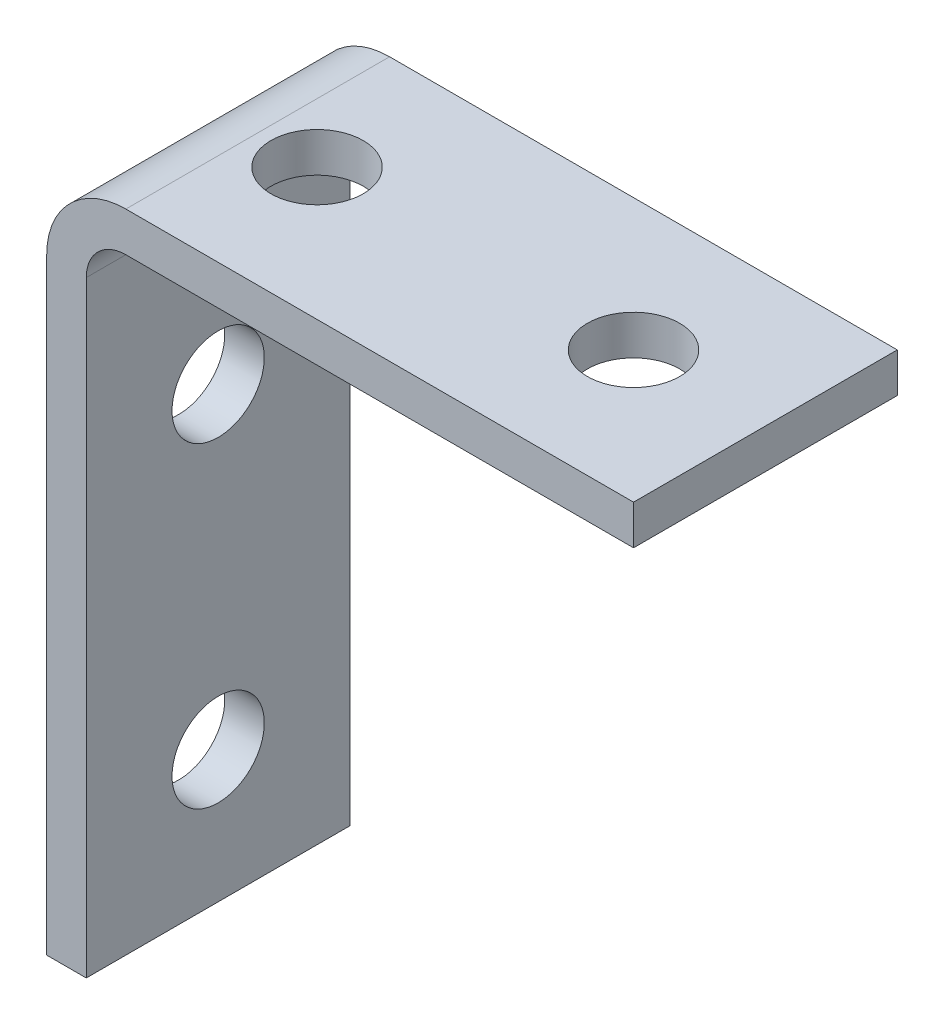
ISO-10303-21;
HEADER;
FILE_DESCRIPTION(('STEP AP214'),'2;1');
FILE_NAME('part.step','',(''),(''),'','','');
FILE_SCHEMA(('AUTOMOTIVE_DESIGN { 1 0 10303 214 1 1 1 1 }'));
ENDSEC;
DATA;
#1=APPLICATION_CONTEXT('core data for automotive mechanical design processes');
#2=APPLICATION_PROTOCOL_DEFINITION('international standard','automotive_design',2000,#1);
#3=PRODUCT_CONTEXT('',#1,'mechanical');
#4=PRODUCT('Part','Part','',(#3));
#5=PRODUCT_RELATED_PRODUCT_CATEGORY('part','',(#4));
#6=PRODUCT_DEFINITION_FORMATION('','',#4);
#7=PRODUCT_DEFINITION_CONTEXT('part definition',#1,'design');
#8=PRODUCT_DEFINITION('design','',#6,#7);
#9=PRODUCT_DEFINITION_SHAPE('','',#8);
#10=(LENGTH_UNIT() NAMED_UNIT(*) SI_UNIT(.MILLI.,.METRE.));
#11=(NAMED_UNIT(*) PLANE_ANGLE_UNIT() SI_UNIT($,.RADIAN.));
#12=(NAMED_UNIT(*) SI_UNIT($,.STERADIAN.) SOLID_ANGLE_UNIT());
#13=UNCERTAINTY_MEASURE_WITH_UNIT(LENGTH_MEASURE(1.E-05),#10,'distance_accuracy_value','');
#14=(GEOMETRIC_REPRESENTATION_CONTEXT(3) GLOBAL_UNCERTAINTY_ASSIGNED_CONTEXT((#13)) GLOBAL_UNIT_ASSIGNED_CONTEXT((#10,
#11,#12)) REPRESENTATION_CONTEXT('',''));
#15=CARTESIAN_POINT('',(0.,0.,0.));
#16=DIRECTION('',(0.,0.,1.));
#17=DIRECTION('',(1.,0.,0.));
#18=AXIS2_PLACEMENT_3D('',#15,#16,#17);
#19=CARTESIAN_POINT('',(3.62528103796382E-13,104.000000000001,-40.0000000000001));
#20=DIRECTION('',(-1.,0.,0.));
#21=DIRECTION('',(0.,-1.,0.));
#22=AXIS2_PLACEMENT_3D('',#19,#20,#21);
#23=PLANE('',#22);
#24=CARTESIAN_POINT('',(0.,68.0000000000013,-19.9999999999999));
#25=DIRECTION('',(-1.,0.,0.));
#26=DIRECTION('',(0.,0.,1.));
#27=AXIS2_PLACEMENT_3D('',#24,#25,#26);
#28=CIRCLE('',#27,6.99999999999998);
#29=CARTESIAN_POINT('',(0.,68.0000000000013,-13.));
#30=VERTEX_POINT('',#29);
#31=EDGE_CURVE('E145',#30,#30,#28,.T.);
#32=ORIENTED_EDGE('',*,*,#31,.F.);
#33=EDGE_LOOP('',(#32));
#34=FACE_BOUND('',#33,.T.);
#35=CARTESIAN_POINT('',(0.,20.0000000000014,-19.9999999999999));
#36=DIRECTION('',(-1.,0.,0.));
#37=DIRECTION('',(0.,0.,1.));
#38=AXIS2_PLACEMENT_3D('',#35,#36,#37);
#39=CIRCLE('',#38,6.99999999999998);
#40=CARTESIAN_POINT('',(0.,20.0000000000014,-13.));
#41=VERTEX_POINT('',#40);
#42=EDGE_CURVE('E141',#41,#41,#39,.T.);
#43=ORIENTED_EDGE('',*,*,#42,.F.);
#44=EDGE_LOOP('',(#43));
#45=FACE_BOUND('',#44,.T.);
#46=DIRECTION('',(0.,-1.,0.));
#47=VECTOR('',#46,1.);
#48=CARTESIAN_POINT('',(3.62528103796382E-13,104.000000000001,0.));
#49=LINE('',#48,#47);
#50=CARTESIAN_POINT('',(3.60329697386423E-13,92.0000000000014,0.));
#51=VERTEX_POINT('',#50);
#52=CARTESIAN_POINT('',(3.43475248243408E-13,1.25512545235545E-12,0.));
#53=VERTEX_POINT('',#52);
#54=EDGE_CURVE('E119',#51,#53,#49,.T.);
#55=ORIENTED_EDGE('',*,*,#54,.F.);
#56=DIRECTION('',(0.,0.,1.));
#57=VECTOR('',#56,1.);
#58=CARTESIAN_POINT('',(3.60329697386423E-13,92.0000000000014,-40.0000000000001));
#59=LINE('',#58,#57);
#60=CARTESIAN_POINT('',(3.60329697386423E-13,92.0000000000014,-40.0000000000001));
#61=VERTEX_POINT('',#60);
#62=EDGE_CURVE('E41',#51,#61,#59,.F.);
#63=ORIENTED_EDGE('',*,*,#62,.T.);
#64=DIRECTION('',(0.,-1.,0.));
#65=VECTOR('',#64,1.);
#66=CARTESIAN_POINT('',(3.62528103796382E-13,104.000000000001,-40.0000000000001));
#67=LINE('',#66,#65);
#68=CARTESIAN_POINT('',(3.43475248243408E-13,1.25512545235545E-12,-40.0000000000001));
#69=VERTEX_POINT('',#68);
#70=EDGE_CURVE('E129',#61,#69,#67,.T.);
#71=ORIENTED_EDGE('',*,*,#70,.T.);
#72=DIRECTION('',(0.,0.,1.));
#73=VECTOR('',#72,1.);
#74=CARTESIAN_POINT('',(3.43475248243408E-13,1.25512545235545E-12,-40.0000000000001));
#75=LINE('',#74,#73);
#76=EDGE_CURVE('E134',#69,#53,#75,.T.);
#77=ORIENTED_EDGE('',*,*,#76,.T.);
#78=EDGE_LOOP('',(#55,#63,#71,#77));
#79=FACE_BOUND('',#78,.T.);
#80=ADVANCED_FACE('F33',(#34,#45,#79),#23,.T.);
#81=CARTESIAN_POINT('',(89.0000000000004,104.000000000001,-40.0000000000001));
#82=DIRECTION('',(0.,1.,0.));
#83=DIRECTION('',(-1.,0.,0.));
#84=AXIS2_PLACEMENT_3D('',#81,#82,#83);
#85=PLANE('',#84);
#86=CARTESIAN_POINT('',(69.0000000000004,104.000000000001,-20.));
#87=DIRECTION('',(0.,-1.,0.));
#88=DIRECTION('',(0.,0.,-1.));
#89=AXIS2_PLACEMENT_3D('',#86,#87,#88);
#90=CIRCLE('',#89,6.99999999999998);
#91=CARTESIAN_POINT('',(69.0000000000004,104.000000000001,-26.9999999999999));
#92=VERTEX_POINT('',#91);
#93=EDGE_CURVE('E194',#92,#92,#90,.T.);
#94=ORIENTED_EDGE('',*,*,#93,.T.);
#95=EDGE_LOOP('',(#94));
#96=FACE_BOUND('',#95,.T.);
#97=CARTESIAN_POINT('',(21.0000000000004,104.000000000001,-19.9999999999999));
#98=DIRECTION('',(0.,-1.,0.));
#99=DIRECTION('',(0.,0.,-1.));
#100=AXIS2_PLACEMENT_3D('',#97,#98,#99);
#101=CIRCLE('',#100,6.99999999999998);
#102=CARTESIAN_POINT('',(21.0000000000004,104.000000000001,-26.9999999999999));
#103=VERTEX_POINT('',#102);
#104=EDGE_CURVE('E188',#103,#103,#101,.T.);
#105=ORIENTED_EDGE('',*,*,#104,.T.);
#106=EDGE_LOOP('',(#105));
#107=FACE_BOUND('',#106,.T.);
#108=DIRECTION('',(-1.,0.,0.));
#109=VECTOR('',#108,1.);
#110=CARTESIAN_POINT('',(89.0000000000004,104.000000000001,-40.0000000000001));
#111=LINE('',#110,#109);
#112=CARTESIAN_POINT('',(89.0000000000004,104.000000000001,-40.0000000000001));
#113=VERTEX_POINT('',#112);
#114=CARTESIAN_POINT('',(12.0000000000004,104.000000000001,-40.0000000000001));
#115=VERTEX_POINT('',#114);
#116=EDGE_CURVE('E136',#113,#115,#111,.T.);
#117=ORIENTED_EDGE('',*,*,#116,.T.);
#118=DIRECTION('',(0.,0.,1.));
#119=VECTOR('',#118,1.);
#120=CARTESIAN_POINT('',(12.0000000000004,104.000000000001,-40.0000000000001));
#121=LINE('',#120,#119);
#122=CARTESIAN_POINT('',(12.0000000000004,104.000000000001,0.));
#123=VERTEX_POINT('',#122);
#124=EDGE_CURVE('E153',#115,#123,#121,.T.);
#125=ORIENTED_EDGE('',*,*,#124,.T.);
#126=DIRECTION('',(-1.,0.,0.));
#127=VECTOR('',#126,1.);
#128=CARTESIAN_POINT('',(89.0000000000004,104.000000000001,0.));
#129=LINE('',#128,#127);
#130=CARTESIAN_POINT('',(89.0000000000004,104.000000000001,0.));
#131=VERTEX_POINT('',#130);
#132=EDGE_CURVE('E123',#131,#123,#129,.T.);
#133=ORIENTED_EDGE('',*,*,#132,.F.);
#134=DIRECTION('',(0.,0.,1.));
#135=VECTOR('',#134,1.);
#136=CARTESIAN_POINT('',(89.0000000000004,104.000000000001,-40.0000000000001));
#137=LINE('',#136,#135);
#138=EDGE_CURVE('E130',#113,#131,#137,.T.);
#139=ORIENTED_EDGE('',*,*,#138,.F.);
#140=EDGE_LOOP('',(#117,#125,#133,#139));
#141=FACE_BOUND('',#140,.T.);
#142=ADVANCED_FACE('F160',(#96,#107,#141),#85,.T.);
#143=CARTESIAN_POINT('',(89.0000000000003,1.1820586420493E-12,-40.0000000000001));
#144=DIRECTION('',(1.,0.,0.));
#145=DIRECTION('',(0.,1.,0.));
#146=AXIS2_PLACEMENT_3D('',#143,#144,#145);
#147=PLANE('',#146);
#148=DIRECTION('',(0.,0.,-1.));
#149=VECTOR('',#148,1.);
#150=CARTESIAN_POINT('',(89.0000000000004,98.0000000000012,0.));
#151=LINE('',#150,#149);
#152=CARTESIAN_POINT('',(89.0000000000004,98.0000000000012,0.));
#153=VERTEX_POINT('',#152);
#154=CARTESIAN_POINT('',(89.0000000000004,98.0000000000012,-40.0000000000001));
#155=VERTEX_POINT('',#154);
#156=EDGE_CURVE('E116',#153,#155,#151,.T.);
#157=ORIENTED_EDGE('',*,*,#156,.T.);
#158=DIRECTION('',(0.,1.,0.));
#159=VECTOR('',#158,1.);
#160=CARTESIAN_POINT('',(89.0000000000003,1.1820586420493E-12,-40.0000000000001));
#161=LINE('',#160,#159);
#162=EDGE_CURVE('E172',#155,#113,#161,.T.);
#163=ORIENTED_EDGE('',*,*,#162,.T.);
#164=ORIENTED_EDGE('',*,*,#138,.T.);
#165=DIRECTION('',(0.,1.,0.));
#166=VECTOR('',#165,1.);
#167=CARTESIAN_POINT('',(89.0000000000003,1.1820586420493E-12,0.));
#168=LINE('',#167,#166);
#169=EDGE_CURVE('E121',#153,#131,#168,.T.);
#170=ORIENTED_EDGE('',*,*,#169,.F.);
#171=EDGE_LOOP('',(#157,#163,#164,#170));
#172=FACE_BOUND('',#171,.T.);
#173=ADVANCED_FACE('F170',(#172),#147,.T.);
#174=CARTESIAN_POINT('',(3.43475248243408E-13,1.25512545235545E-12,-40.0000000000001));
#175=DIRECTION('',(0.,-1.,0.));
#176=DIRECTION('',(1.,0.,0.));
#177=AXIS2_PLACEMENT_3D('',#174,#175,#176);
#178=PLANE('',#177);
#179=DIRECTION('',(0.,0.,-1.));
#180=VECTOR('',#179,1.);
#181=CARTESIAN_POINT('',(6.00000000000035,1.27474981358168E-12,0.));
#182=LINE('',#181,#180);
#183=CARTESIAN_POINT('',(6.00000000000035,1.27474981358168E-12,0.));
#184=VERTEX_POINT('',#183);
#185=CARTESIAN_POINT('',(6.00000000000033,1.2757531459503E-12,-40.0000000000001));
#186=VERTEX_POINT('',#185);
#187=EDGE_CURVE('E99',#184,#186,#182,.T.);
#188=ORIENTED_EDGE('',*,*,#187,.F.);
#189=DIRECTION('',(1.,0.,0.));
#190=VECTOR('',#189,1.);
#191=CARTESIAN_POINT('',(3.43475248243408E-13,1.25512545235545E-12,0.));
#192=LINE('',#191,#190);
#193=EDGE_CURVE('E113',#53,#184,#192,.T.);
#194=ORIENTED_EDGE('',*,*,#193,.F.);
#195=ORIENTED_EDGE('',*,*,#76,.F.);
#196=DIRECTION('',(1.,0.,0.));
#197=VECTOR('',#196,1.);
#198=CARTESIAN_POINT('',(3.43475248243408E-13,1.25512545235545E-12,-40.0000000000001));
#199=LINE('',#198,#197);
#200=EDGE_CURVE('E115',#69,#186,#199,.T.);
#201=ORIENTED_EDGE('',*,*,#200,.T.);
#202=EDGE_LOOP('',(#188,#194,#195,#201));
#203=FACE_BOUND('',#202,.T.);
#204=ADVANCED_FACE('F111',(#203),#178,.T.);
#205=CARTESIAN_POINT('',(0.,0.,-40.0000000000001));
#206=DIRECTION('',(0.,0.,1.));
#207=DIRECTION('',(1.,0.,0.));
#208=AXIS2_PLACEMENT_3D('',#205,#206,#207);
#209=PLANE('',#208);
#210=ORIENTED_EDGE('',*,*,#70,.F.);
#211=CARTESIAN_POINT('',(12.0000000000004,92.0000000000014,-40.0000000000001));
#212=DIRECTION('',(0.,0.,1.));
#213=DIRECTION('',(1.,0.,0.));
#214=AXIS2_PLACEMENT_3D('',#211,#212,#213);
#215=CIRCLE('',#214,12.);
#216=EDGE_CURVE('E11',#61,#115,#215,.F.);
#217=ORIENTED_EDGE('',*,*,#216,.T.);
#218=ORIENTED_EDGE('',*,*,#116,.F.);
#219=ORIENTED_EDGE('',*,*,#162,.F.);
#220=DIRECTION('',(1.,0.,0.));
#221=VECTOR('',#220,1.);
#222=CARTESIAN_POINT('',(6.00000000000037,98.0000000000012,-40.0000000000001));
#223=LINE('',#222,#221);
#224=CARTESIAN_POINT('',(12.0000000000004,98.0000000000012,-40.0000000000001));
#225=VERTEX_POINT('',#224);
#226=EDGE_CURVE('E106',#225,#155,#223,.T.);
#227=ORIENTED_EDGE('',*,*,#226,.F.);
#228=CARTESIAN_POINT('',(12.0000000000004,92.0000000000012,-40.0000000000001));
#229=DIRECTION('',(0.,0.,1.));
#230=DIRECTION('',(1.,0.,0.));
#231=AXIS2_PLACEMENT_3D('',#228,#229,#230);
#232=CIRCLE('',#231,6.);
#233=CARTESIAN_POINT('',(6.00000000000037,92.0000000000012,-40.0000000000001));
#234=VERTEX_POINT('',#233);
#235=EDGE_CURVE('E149',#225,#234,#232,.T.);
#236=ORIENTED_EDGE('',*,*,#235,.T.);
#237=DIRECTION('',(0.,1.,0.));
#238=VECTOR('',#237,1.);
#239=CARTESIAN_POINT('',(6.00000000000033,1.2757531459503E-12,-40.0000000000001));
#240=LINE('',#239,#238);
#241=EDGE_CURVE('E140',#186,#234,#240,.T.);
#242=ORIENTED_EDGE('',*,*,#241,.F.);
#243=ORIENTED_EDGE('',*,*,#200,.F.);
#244=EDGE_LOOP('',(#210,#217,#218,#219,#227,#236,#242,#243));
#245=FACE_BOUND('',#244,.T.);
#246=ADVANCED_FACE('F174',(#245),#209,.F.);
#247=CARTESIAN_POINT('',(0.,0.,0.));
#248=DIRECTION('',(0.,0.,1.));
#249=DIRECTION('',(1.,0.,0.));
#250=AXIS2_PLACEMENT_3D('',#247,#248,#249);
#251=PLANE('',#250);
#252=ORIENTED_EDGE('',*,*,#132,.T.);
#253=CARTESIAN_POINT('',(12.0000000000004,92.0000000000014,0.));
#254=DIRECTION('',(0.,0.,1.));
#255=DIRECTION('',(1.,0.,0.));
#256=AXIS2_PLACEMENT_3D('',#253,#254,#255);
#257=CIRCLE('',#256,12.);
#258=EDGE_CURVE('E55',#123,#51,#257,.T.);
#259=ORIENTED_EDGE('',*,*,#258,.T.);
#260=ORIENTED_EDGE('',*,*,#54,.T.);
#261=ORIENTED_EDGE('',*,*,#193,.T.);
#262=DIRECTION('',(0.,1.,0.));
#263=VECTOR('',#262,1.);
#264=CARTESIAN_POINT('',(6.00000000000035,1.27474981358168E-12,0.));
#265=LINE('',#264,#263);
#266=CARTESIAN_POINT('',(6.00000000000038,92.0000000000012,0.));
#267=VERTEX_POINT('',#266);
#268=EDGE_CURVE('E95',#184,#267,#265,.T.);
#269=ORIENTED_EDGE('',*,*,#268,.T.);
#270=CARTESIAN_POINT('',(12.0000000000004,92.0000000000012,0.));
#271=DIRECTION('',(0.,0.,1.));
#272=DIRECTION('',(1.,0.,0.));
#273=AXIS2_PLACEMENT_3D('',#270,#271,#272);
#274=CIRCLE('',#273,6.);
#275=CARTESIAN_POINT('',(12.0000000000004,98.0000000000012,0.));
#276=VERTEX_POINT('',#275);
#277=EDGE_CURVE('E151',#267,#276,#274,.F.);
#278=ORIENTED_EDGE('',*,*,#277,.T.);
#279=DIRECTION('',(1.,0.,0.));
#280=VECTOR('',#279,1.);
#281=CARTESIAN_POINT('',(6.00000000000039,98.0000000000012,0.));
#282=LINE('',#281,#280);
#283=EDGE_CURVE('E105',#276,#153,#282,.T.);
#284=ORIENTED_EDGE('',*,*,#283,.T.);
#285=ORIENTED_EDGE('',*,*,#169,.T.);
#286=EDGE_LOOP('',(#252,#259,#260,#261,#269,#278,#284,#285));
#287=FACE_BOUND('',#286,.T.);
#288=ADVANCED_FACE('F118',(#287),#251,.T.);
#289=CARTESIAN_POINT('',(6.00000000000039,98.0000000000012,0.));
#290=DIRECTION('',(0.,1.,0.));
#291=DIRECTION('',(-1.,0.,0.));
#292=AXIS2_PLACEMENT_3D('',#289,#290,#291);
#293=PLANE('',#292);
#294=CARTESIAN_POINT('',(69.0000000000004,98.0000000000012,-20.));
#295=DIRECTION('',(0.,-1.,0.));
#296=DIRECTION('',(0.,0.,-1.));
#297=AXIS2_PLACEMENT_3D('',#294,#295,#296);
#298=CIRCLE('',#297,6.99999999999998);
#299=CARTESIAN_POINT('',(69.0000000000004,98.0000000000012,-26.9999999999999));
#300=VERTEX_POINT('',#299);
#301=EDGE_CURVE('E197',#300,#300,#298,.T.);
#302=ORIENTED_EDGE('',*,*,#301,.F.);
#303=EDGE_LOOP('',(#302));
#304=FACE_BOUND('',#303,.T.);
#305=CARTESIAN_POINT('',(21.0000000000004,98.0000000000012,-19.9999999999999));
#306=DIRECTION('',(0.,-1.,0.));
#307=DIRECTION('',(0.,0.,-1.));
#308=AXIS2_PLACEMENT_3D('',#305,#306,#307);
#309=CIRCLE('',#308,6.99999999999998);
#310=CARTESIAN_POINT('',(21.0000000000004,98.0000000000012,-26.9999999999999));
#311=VERTEX_POINT('',#310);
#312=EDGE_CURVE('E191',#311,#311,#309,.T.);
#313=ORIENTED_EDGE('',*,*,#312,.F.);
#314=EDGE_LOOP('',(#313));
#315=FACE_BOUND('',#314,.T.);
#316=ORIENTED_EDGE('',*,*,#283,.F.);
#317=DIRECTION('',(0.,0.,-1.));
#318=VECTOR('',#317,1.);
#319=CARTESIAN_POINT('',(12.0000000000004,98.0000000000012,-40.0000000000001));
#320=LINE('',#319,#318);
#321=EDGE_CURVE('E133',#276,#225,#320,.T.);
#322=ORIENTED_EDGE('',*,*,#321,.T.);
#323=ORIENTED_EDGE('',*,*,#226,.T.);
#324=ORIENTED_EDGE('',*,*,#156,.F.);
#325=EDGE_LOOP('',(#316,#322,#323,#324));
#326=FACE_BOUND('',#325,.T.);
#327=ADVANCED_FACE('F203',(#304,#315,#326),#293,.F.);
#328=CARTESIAN_POINT('',(6.00000000000035,1.27474981358168E-12,0.));
#329=DIRECTION('',(-1.,0.,0.));
#330=DIRECTION('',(0.,0.,1.));
#331=AXIS2_PLACEMENT_3D('',#328,#329,#330);
#332=PLANE('',#331);
#333=CARTESIAN_POINT('',(6.00000000000037,68.0000000000013,-19.9999999999999));
#334=DIRECTION('',(-1.,0.,0.));
#335=DIRECTION('',(0.,0.,1.));
#336=AXIS2_PLACEMENT_3D('',#333,#334,#335);
#337=CIRCLE('',#336,6.99999999999997);
#338=CARTESIAN_POINT('',(6.00000000000037,68.0000000000013,-13.));
#339=VERTEX_POINT('',#338);
#340=EDGE_CURVE('E142',#339,#339,#337,.T.);
#341=ORIENTED_EDGE('',*,*,#340,.T.);
#342=EDGE_LOOP('',(#341));
#343=FACE_BOUND('',#342,.T.);
#344=CARTESIAN_POINT('',(6.00000000000035,20.0000000000014,-19.9999999999999));
#345=DIRECTION('',(-1.,0.,0.));
#346=DIRECTION('',(0.,0.,1.));
#347=AXIS2_PLACEMENT_3D('',#344,#345,#346);
#348=CIRCLE('',#347,6.99999999999998);
#349=CARTESIAN_POINT('',(6.00000000000035,20.0000000000014,-13.));
#350=VERTEX_POINT('',#349);
#351=EDGE_CURVE('E137',#350,#350,#348,.T.);
#352=ORIENTED_EDGE('',*,*,#351,.T.);
#353=EDGE_LOOP('',(#352));
#354=FACE_BOUND('',#353,.T.);
#355=ORIENTED_EDGE('',*,*,#241,.T.);
#356=DIRECTION('',(0.,0.,-1.));
#357=VECTOR('',#356,1.);
#358=CARTESIAN_POINT('',(6.00000000000038,92.0000000000012,0.));
#359=LINE('',#358,#357);
#360=EDGE_CURVE('E102',#234,#267,#359,.F.);
#361=ORIENTED_EDGE('',*,*,#360,.T.);
#362=ORIENTED_EDGE('',*,*,#268,.F.);
#363=ORIENTED_EDGE('',*,*,#187,.T.);
#364=EDGE_LOOP('',(#355,#361,#362,#363));
#365=FACE_BOUND('',#364,.T.);
#366=ADVANCED_FACE('F98',(#343,#354,#365),#332,.F.);
#367=CARTESIAN_POINT('',(0.,20.0000000000014,-19.9999999999999));
#368=DIRECTION('',(-1.,0.,0.));
#369=DIRECTION('',(0.,0.,1.));
#370=AXIS2_PLACEMENT_3D('',#367,#368,#369);
#371=CYLINDRICAL_SURFACE('',#370,6.99999999999998);
#372=ORIENTED_EDGE('',*,*,#42,.T.);
#373=EDGE_LOOP('',(#372));
#374=FACE_BOUND('',#373,.T.);
#375=ORIENTED_EDGE('',*,*,#351,.F.);
#376=EDGE_LOOP('',(#375));
#377=FACE_BOUND('',#376,.T.);
#378=ADVANCED_FACE('F236',(#374,#377),#371,.F.);
#379=CARTESIAN_POINT('',(0.,68.0000000000013,-19.9999999999999));
#380=DIRECTION('',(-1.,0.,0.));
#381=DIRECTION('',(0.,0.,1.));
#382=AXIS2_PLACEMENT_3D('',#379,#380,#381);
#383=CYLINDRICAL_SURFACE('',#382,6.99999999999997);
#384=ORIENTED_EDGE('',*,*,#31,.T.);
#385=EDGE_LOOP('',(#384));
#386=FACE_BOUND('',#385,.T.);
#387=ORIENTED_EDGE('',*,*,#340,.F.);
#388=EDGE_LOOP('',(#387));
#389=FACE_BOUND('',#388,.T.);
#390=ADVANCED_FACE('F241',(#386,#389),#383,.F.);
#391=CARTESIAN_POINT('',(21.0000000000004,98.0000000000012,-19.9999999999999));
#392=DIRECTION('',(0.,-1.,0.));
#393=DIRECTION('',(0.,0.,-1.));
#394=AXIS2_PLACEMENT_3D('',#391,#392,#393);
#395=CYLINDRICAL_SURFACE('',#394,6.99999999999998);
#396=ORIENTED_EDGE('',*,*,#104,.F.);
#397=EDGE_LOOP('',(#396));
#398=FACE_BOUND('',#397,.T.);
#399=ORIENTED_EDGE('',*,*,#312,.T.);
#400=EDGE_LOOP('',(#399));
#401=FACE_BOUND('',#400,.T.);
#402=ADVANCED_FACE('F245',(#398,#401),#395,.F.);
#403=CARTESIAN_POINT('',(69.0000000000004,98.0000000000012,-20.));
#404=DIRECTION('',(0.,-1.,0.));
#405=DIRECTION('',(0.,0.,-1.));
#406=AXIS2_PLACEMENT_3D('',#403,#404,#405);
#407=CYLINDRICAL_SURFACE('',#406,6.99999999999998);
#408=ORIENTED_EDGE('',*,*,#93,.F.);
#409=EDGE_LOOP('',(#408));
#410=FACE_BOUND('',#409,.T.);
#411=ORIENTED_EDGE('',*,*,#301,.T.);
#412=EDGE_LOOP('',(#411));
#413=FACE_BOUND('',#412,.T.);
#414=ADVANCED_FACE('F201',(#410,#413),#407,.F.);
#415=CARTESIAN_POINT('',(12.0000000000004,92.0000000000012,0.));
#416=DIRECTION('',(0.,0.,1.));
#417=DIRECTION('',(1.,0.,0.));
#418=AXIS2_PLACEMENT_3D('',#415,#416,#417);
#419=CYLINDRICAL_SURFACE('',#418,6.);
#420=ORIENTED_EDGE('',*,*,#277,.F.);
#421=ORIENTED_EDGE('',*,*,#360,.F.);
#422=ORIENTED_EDGE('',*,*,#235,.F.);
#423=ORIENTED_EDGE('',*,*,#321,.F.);
#424=EDGE_LOOP('',(#420,#421,#422,#423));
#425=FACE_BOUND('',#424,.T.);
#426=ADVANCED_FACE('F211',(#425),#419,.F.);
#427=CARTESIAN_POINT('',(12.0000000000004,92.0000000000014,-40.0000000000001));
#428=DIRECTION('',(0.,0.,1.));
#429=DIRECTION('',(1.,0.,0.));
#430=AXIS2_PLACEMENT_3D('',#427,#428,#429);
#431=CYLINDRICAL_SURFACE('',#430,12.);
#432=ORIENTED_EDGE('',*,*,#216,.F.);
#433=ORIENTED_EDGE('',*,*,#62,.F.);
#434=ORIENTED_EDGE('',*,*,#258,.F.);
#435=ORIENTED_EDGE('',*,*,#124,.F.);
#436=EDGE_LOOP('',(#432,#433,#434,#435));
#437=FACE_BOUND('',#436,.T.);
#438=ADVANCED_FACE('F35',(#437),#431,.T.);
#439=CLOSED_SHELL('',(#80,#142,#173,#204,#246,#288,#327,#366,#378,#390,#402,#414,#426,#438));
#440=MANIFOLD_SOLID_BREP('B2',#439);
#441=ADVANCED_BREP_SHAPE_REPRESENTATION('',(#18,#440),#14);
#442=SHAPE_DEFINITION_REPRESENTATION(#9,#441);
ENDSEC;
END-ISO-10303-21;
